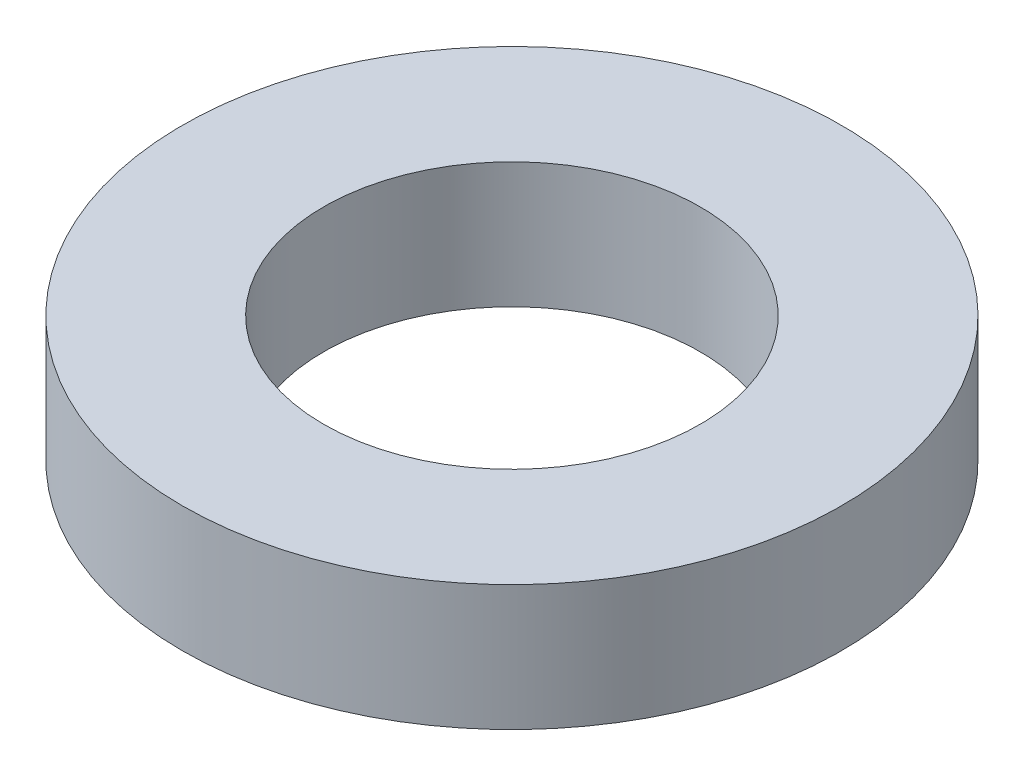
ISO-10303-21;
HEADER;
FILE_DESCRIPTION(('STEP AP214'),'2;1');
FILE_NAME('part.step','',(''),(''),'','','');
FILE_SCHEMA(('AUTOMOTIVE_DESIGN { 1 0 10303 214 1 1 1 1 }'));
ENDSEC;
DATA;
#1=APPLICATION_CONTEXT('core data for automotive mechanical design processes');
#2=APPLICATION_PROTOCOL_DEFINITION('international standard','automotive_design',2000,#1);
#3=PRODUCT_CONTEXT('',#1,'mechanical');
#4=PRODUCT('Part','Part','',(#3));
#5=PRODUCT_RELATED_PRODUCT_CATEGORY('part','',(#4));
#6=PRODUCT_DEFINITION_FORMATION('','',#4);
#7=PRODUCT_DEFINITION_CONTEXT('part definition',#1,'design');
#8=PRODUCT_DEFINITION('design','',#6,#7);
#9=PRODUCT_DEFINITION_SHAPE('','',#8);
#10=(LENGTH_UNIT() NAMED_UNIT(*) SI_UNIT(.MILLI.,.METRE.));
#11=(NAMED_UNIT(*) PLANE_ANGLE_UNIT() SI_UNIT($,.RADIAN.));
#12=(NAMED_UNIT(*) SI_UNIT($,.STERADIAN.) SOLID_ANGLE_UNIT());
#13=UNCERTAINTY_MEASURE_WITH_UNIT(LENGTH_MEASURE(1.E-05),#10,'distance_accuracy_value','');
#14=(GEOMETRIC_REPRESENTATION_CONTEXT(3) GLOBAL_UNCERTAINTY_ASSIGNED_CONTEXT((#13)) GLOBAL_UNIT_ASSIGNED_CONTEXT((#10,
#11,#12)) REPRESENTATION_CONTEXT('',''));
#15=CARTESIAN_POINT('',(0.,0.,0.));
#16=DIRECTION('',(0.,0.,1.));
#17=DIRECTION('',(1.,0.,0.));
#18=AXIS2_PLACEMENT_3D('',#15,#16,#17);
#19=CARTESIAN_POINT('',(0.,20.,0.));
#20=DIRECTION('',(0.,-1.,0.));
#21=DIRECTION('',(0.,0.,-1.));
#22=AXIS2_PLACEMENT_3D('',#19,#20,#21);
#23=CYLINDRICAL_SURFACE('',#22,52.5);
#24=CARTESIAN_POINT('',(0.,20.,0.));
#25=DIRECTION('',(0.,1.,0.));
#26=DIRECTION('',(0.,0.,1.));
#27=AXIS2_PLACEMENT_3D('',#24,#25,#26);
#28=CIRCLE('',#27,52.5);
#29=CARTESIAN_POINT('',(0.,20.,52.5));
#30=VERTEX_POINT('',#29);
#31=EDGE_CURVE('E10',#30,#30,#28,.T.);
#32=ORIENTED_EDGE('',*,*,#31,.F.);
#33=EDGE_LOOP('',(#32));
#34=FACE_BOUND('',#33,.T.);
#35=CARTESIAN_POINT('',(0.,0.,0.));
#36=DIRECTION('',(0.,1.,0.));
#37=DIRECTION('',(0.,0.,1.));
#38=AXIS2_PLACEMENT_3D('',#35,#36,#37);
#39=CIRCLE('',#38,52.5);
#40=CARTESIAN_POINT('',(0.,0.,52.5));
#41=VERTEX_POINT('',#40);
#42=EDGE_CURVE('E37',#41,#41,#39,.T.);
#43=ORIENTED_EDGE('',*,*,#42,.T.);
#44=EDGE_LOOP('',(#43));
#45=FACE_BOUND('',#44,.T.);
#46=ADVANCED_FACE('F40',(#34,#45),#23,.T.);
#47=CARTESIAN_POINT('',(0.,20.,0.));
#48=DIRECTION('',(0.,1.,0.));
#49=DIRECTION('',(0.,0.,1.));
#50=AXIS2_PLACEMENT_3D('',#47,#48,#49);
#51=PLANE('',#50);
#52=CARTESIAN_POINT('',(0.,20.,0.));
#53=DIRECTION('',(0.,1.,0.));
#54=DIRECTION('',(0.,0.,1.));
#55=AXIS2_PLACEMENT_3D('',#52,#53,#54);
#56=CIRCLE('',#55,30.);
#57=CARTESIAN_POINT('',(0.,20.,30.));
#58=VERTEX_POINT('',#57);
#59=EDGE_CURVE('E50',#58,#58,#56,.T.);
#60=ORIENTED_EDGE('',*,*,#59,.F.);
#61=EDGE_LOOP('',(#60));
#62=FACE_BOUND('',#61,.T.);
#63=ORIENTED_EDGE('',*,*,#31,.T.);
#64=EDGE_LOOP('',(#63));
#65=FACE_BOUND('',#64,.T.);
#66=ADVANCED_FACE('F59',(#62,#65),#51,.T.);
#67=CARTESIAN_POINT('',(0.,0.,0.));
#68=DIRECTION('',(0.,1.,0.));
#69=DIRECTION('',(0.,0.,1.));
#70=AXIS2_PLACEMENT_3D('',#67,#68,#69);
#71=PLANE('',#70);
#72=CARTESIAN_POINT('',(0.,0.,0.));
#73=DIRECTION('',(0.,1.,0.));
#74=DIRECTION('',(0.,0.,1.));
#75=AXIS2_PLACEMENT_3D('',#72,#73,#74);
#76=CIRCLE('',#75,30.);
#77=CARTESIAN_POINT('',(0.,0.,30.));
#78=VERTEX_POINT('',#77);
#79=EDGE_CURVE('E47',#78,#78,#76,.T.);
#80=ORIENTED_EDGE('',*,*,#79,.T.);
#81=EDGE_LOOP('',(#80));
#82=FACE_BOUND('',#81,.T.);
#83=ORIENTED_EDGE('',*,*,#42,.F.);
#84=EDGE_LOOP('',(#83));
#85=FACE_BOUND('',#84,.T.);
#86=ADVANCED_FACE('F58',(#82,#85),#71,.F.);
#87=CARTESIAN_POINT('',(0.,20.,0.));
#88=DIRECTION('',(0.,-1.,0.));
#89=DIRECTION('',(0.,0.,-1.));
#90=AXIS2_PLACEMENT_3D('',#87,#88,#89);
#91=CYLINDRICAL_SURFACE('',#90,30.);
#92=ORIENTED_EDGE('',*,*,#59,.T.);
#93=EDGE_LOOP('',(#92));
#94=FACE_BOUND('',#93,.T.);
#95=ORIENTED_EDGE('',*,*,#79,.F.);
#96=EDGE_LOOP('',(#95));
#97=FACE_BOUND('',#96,.T.);
#98=ADVANCED_FACE('F54',(#94,#97),#91,.F.);
#99=CLOSED_SHELL('',(#46,#66,#86,#98));
#100=MANIFOLD_SOLID_BREP('B2',#99);
#101=ADVANCED_BREP_SHAPE_REPRESENTATION('',(#18,#100),#14);
#102=SHAPE_DEFINITION_REPRESENTATION(#9,#101);
ENDSEC;
END-ISO-10303-21;
